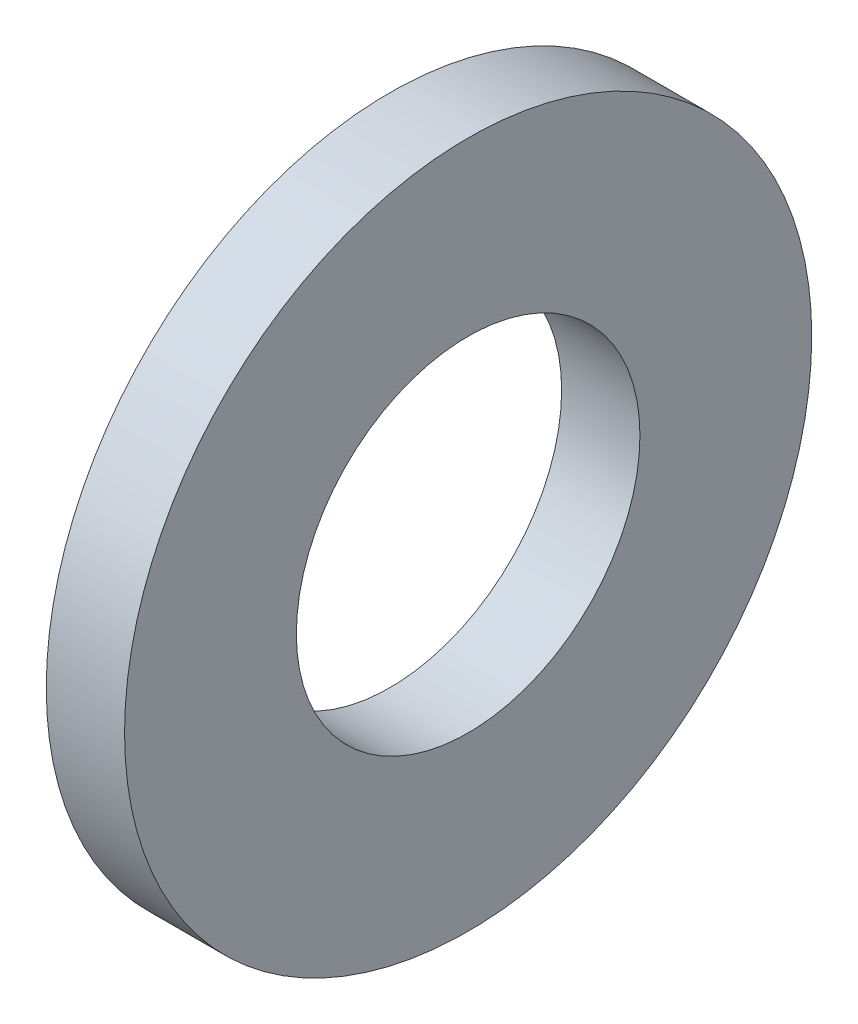
ISO-10303-21;
HEADER;
FILE_DESCRIPTION(('STEP AP214'),'2;1');
FILE_NAME('part.step','',(''),(''),'','','');
FILE_SCHEMA(('AUTOMOTIVE_DESIGN { 1 0 10303 214 1 1 1 1 }'));
ENDSEC;
DATA;
#1=APPLICATION_CONTEXT('core data for automotive mechanical design processes');
#2=APPLICATION_PROTOCOL_DEFINITION('international standard','automotive_design',2000,#1);
#3=PRODUCT_CONTEXT('',#1,'mechanical');
#4=PRODUCT('Part','Part','',(#3));
#5=PRODUCT_RELATED_PRODUCT_CATEGORY('part','',(#4));
#6=PRODUCT_DEFINITION_FORMATION('','',#4);
#7=PRODUCT_DEFINITION_CONTEXT('part definition',#1,'design');
#8=PRODUCT_DEFINITION('design','',#6,#7);
#9=PRODUCT_DEFINITION_SHAPE('','',#8);
#10=(LENGTH_UNIT() NAMED_UNIT(*) SI_UNIT(.MILLI.,.METRE.));
#11=(NAMED_UNIT(*) PLANE_ANGLE_UNIT() SI_UNIT($,.RADIAN.));
#12=(NAMED_UNIT(*) SI_UNIT($,.STERADIAN.) SOLID_ANGLE_UNIT());
#13=UNCERTAINTY_MEASURE_WITH_UNIT(LENGTH_MEASURE(1.E-05),#10,'distance_accuracy_value','');
#14=(GEOMETRIC_REPRESENTATION_CONTEXT(3) GLOBAL_UNCERTAINTY_ASSIGNED_CONTEXT((#13)) GLOBAL_UNIT_ASSIGNED_CONTEXT((#10,
#11,#12)) REPRESENTATION_CONTEXT('',''));
#15=CARTESIAN_POINT('',(0.,0.,0.));
#16=DIRECTION('',(0.,0.,1.));
#17=DIRECTION('',(1.,0.,0.));
#18=AXIS2_PLACEMENT_3D('',#15,#16,#17);
#19=CARTESIAN_POINT('',(3.0734,0.,0.));
#20=DIRECTION('',(1.,0.,0.));
#21=DIRECTION('',(0.,0.,-1.));
#22=AXIS2_PLACEMENT_3D('',#19,#20,#21);
#23=PLANE('',#22);
#24=CARTESIAN_POINT('',(3.0734,0.,0.));
#25=DIRECTION('',(1.,0.,0.));
#26=DIRECTION('',(0.,0.,-1.));
#27=AXIS2_PLACEMENT_3D('',#24,#25,#26);
#28=CIRCLE('',#27,13.4874);
#29=CARTESIAN_POINT('',(3.0734,0.,-13.4874));
#30=VERTEX_POINT('',#29);
#31=EDGE_CURVE('E10',#30,#30,#28,.T.);
#32=ORIENTED_EDGE('',*,*,#31,.T.);
#33=EDGE_LOOP('',(#32));
#34=FACE_BOUND('',#33,.T.);
#35=CARTESIAN_POINT('',(3.0734,0.,0.));
#36=DIRECTION('',(1.,0.,0.));
#37=DIRECTION('',(0.,0.,-1.));
#38=AXIS2_PLACEMENT_3D('',#35,#36,#37);
#39=CIRCLE('',#38,6.7437);
#40=CARTESIAN_POINT('',(3.0734,0.,-6.7437));
#41=VERTEX_POINT('',#40);
#42=EDGE_CURVE('E41',#41,#41,#39,.T.);
#43=ORIENTED_EDGE('',*,*,#42,.F.);
#44=EDGE_LOOP('',(#43));
#45=FACE_BOUND('',#44,.T.);
#46=ADVANCED_FACE('F30',(#34,#45),#23,.T.);
#47=CARTESIAN_POINT('',(0.,0.,0.));
#48=DIRECTION('',(1.,0.,0.));
#49=DIRECTION('',(0.,0.,-1.));
#50=AXIS2_PLACEMENT_3D('',#47,#48,#49);
#51=PLANE('',#50);
#52=CARTESIAN_POINT('',(0.,0.,0.));
#53=DIRECTION('',(1.,0.,0.));
#54=DIRECTION('',(0.,0.,-1.));
#55=AXIS2_PLACEMENT_3D('',#52,#53,#54);
#56=CIRCLE('',#55,13.4874);
#57=CARTESIAN_POINT('',(0.,0.,-13.4874));
#58=VERTEX_POINT('',#57);
#59=EDGE_CURVE('E34',#58,#58,#56,.T.);
#60=ORIENTED_EDGE('',*,*,#59,.F.);
#61=EDGE_LOOP('',(#60));
#62=FACE_BOUND('',#61,.T.);
#63=CARTESIAN_POINT('',(0.,0.,0.));
#64=DIRECTION('',(1.,0.,0.));
#65=DIRECTION('',(0.,0.,-1.));
#66=AXIS2_PLACEMENT_3D('',#63,#64,#65);
#67=CIRCLE('',#66,6.7437);
#68=CARTESIAN_POINT('',(0.,0.,-6.7437));
#69=VERTEX_POINT('',#68);
#70=EDGE_CURVE('E43',#69,#69,#67,.T.);
#71=ORIENTED_EDGE('',*,*,#70,.T.);
#72=EDGE_LOOP('',(#71));
#73=FACE_BOUND('',#72,.T.);
#74=ADVANCED_FACE('F53',(#62,#73),#51,.F.);
#75=CARTESIAN_POINT('',(3.0734,0.,0.));
#76=DIRECTION('',(-1.,0.,0.));
#77=DIRECTION('',(0.,0.,1.));
#78=AXIS2_PLACEMENT_3D('',#75,#76,#77);
#79=CYLINDRICAL_SURFACE('',#78,13.4874);
#80=ORIENTED_EDGE('',*,*,#31,.F.);
#81=EDGE_LOOP('',(#80));
#82=FACE_BOUND('',#81,.T.);
#83=ORIENTED_EDGE('',*,*,#59,.T.);
#84=EDGE_LOOP('',(#83));
#85=FACE_BOUND('',#84,.T.);
#86=ADVANCED_FACE('F32',(#82,#85),#79,.T.);
#87=CARTESIAN_POINT('',(3.0734,0.,0.));
#88=DIRECTION('',(-1.,0.,0.));
#89=DIRECTION('',(0.,0.,1.));
#90=AXIS2_PLACEMENT_3D('',#87,#88,#89);
#91=CYLINDRICAL_SURFACE('',#90,6.7437);
#92=ORIENTED_EDGE('',*,*,#42,.T.);
#93=EDGE_LOOP('',(#92));
#94=FACE_BOUND('',#93,.T.);
#95=ORIENTED_EDGE('',*,*,#70,.F.);
#96=EDGE_LOOP('',(#95));
#97=FACE_BOUND('',#96,.T.);
#98=ADVANCED_FACE('F49',(#94,#97),#91,.F.);
#99=CLOSED_SHELL('',(#46,#74,#86,#98));
#100=MANIFOLD_SOLID_BREP('B2',#99);
#101=ADVANCED_BREP_SHAPE_REPRESENTATION('',(#18,#100),#14);
#102=SHAPE_DEFINITION_REPRESENTATION(#9,#101);
ENDSEC;
END-ISO-10303-21;
